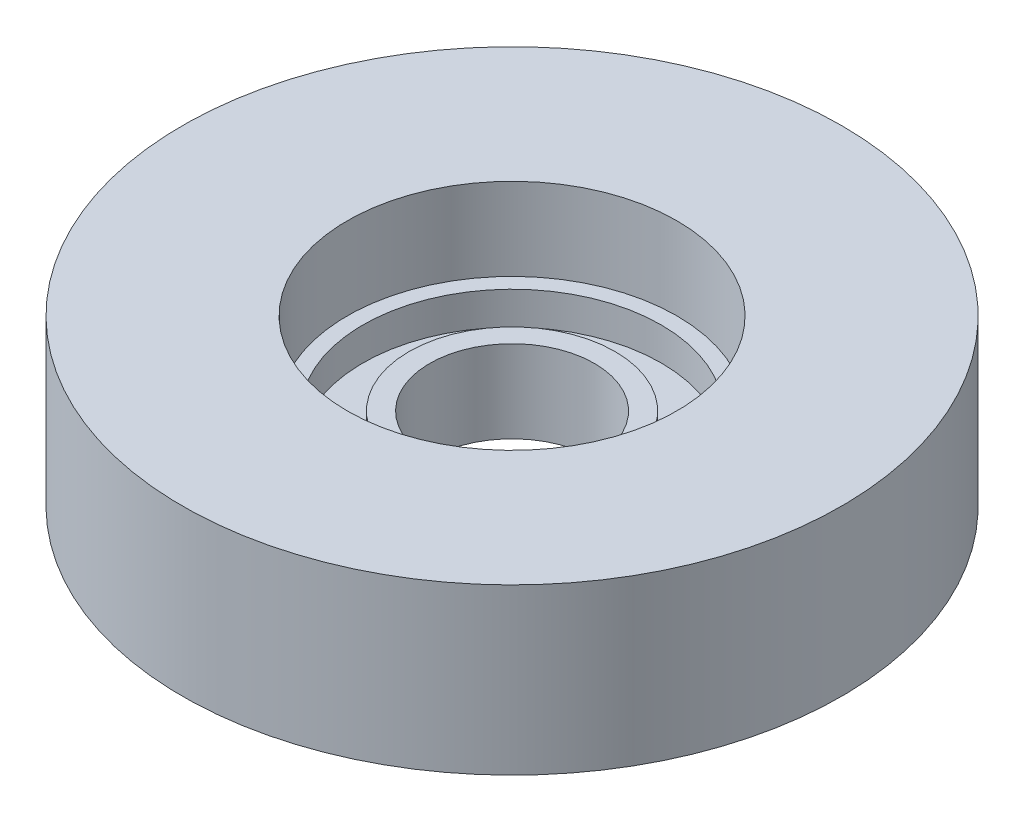
ISO-10303-21;
HEADER;
FILE_DESCRIPTION(('STEP AP214'),'2;1');
FILE_NAME('part.step','',(''),(''),'','','');
FILE_SCHEMA(('AUTOMOTIVE_DESIGN { 1 0 10303 214 1 1 1 1 }'));
ENDSEC;
DATA;
#1=APPLICATION_CONTEXT('core data for automotive mechanical design processes');
#2=APPLICATION_PROTOCOL_DEFINITION('international standard','automotive_design',2000,#1);
#3=PRODUCT_CONTEXT('',#1,'mechanical');
#4=PRODUCT('Part','Part','',(#3));
#5=PRODUCT_RELATED_PRODUCT_CATEGORY('part','',(#4));
#6=PRODUCT_DEFINITION_FORMATION('','',#4);
#7=PRODUCT_DEFINITION_CONTEXT('part definition',#1,'design');
#8=PRODUCT_DEFINITION('design','',#6,#7);
#9=PRODUCT_DEFINITION_SHAPE('','',#8);
#10=(LENGTH_UNIT() NAMED_UNIT(*) SI_UNIT(.MILLI.,.METRE.));
#11=(NAMED_UNIT(*) PLANE_ANGLE_UNIT() SI_UNIT($,.RADIAN.));
#12=(NAMED_UNIT(*) SI_UNIT($,.STERADIAN.) SOLID_ANGLE_UNIT());
#13=UNCERTAINTY_MEASURE_WITH_UNIT(LENGTH_MEASURE(1.E-05),#10,'distance_accuracy_value','');
#14=(GEOMETRIC_REPRESENTATION_CONTEXT(3) GLOBAL_UNCERTAINTY_ASSIGNED_CONTEXT((#13)) GLOBAL_UNIT_ASSIGNED_CONTEXT((#10,
#11,#12)) REPRESENTATION_CONTEXT('',''));
#15=CARTESIAN_POINT('',(0.,0.,0.));
#16=DIRECTION('',(0.,0.,1.));
#17=DIRECTION('',(1.,0.,0.));
#18=AXIS2_PLACEMENT_3D('',#15,#16,#17);
#19=CARTESIAN_POINT('',(-20.2565,0.,0.));
#20=DIRECTION('',(0.,1.,0.));
#21=DIRECTION('',(0.,0.,1.));
#22=AXIS2_PLACEMENT_3D('',#19,#20,#21);
#23=PLANE('',#22);
#24=CARTESIAN_POINT('',(0.,0.,0.));
#25=DIRECTION('',(0.,-1.,0.));
#26=DIRECTION('',(0.,0.,-1.));
#27=AXIS2_PLACEMENT_3D('',#24,#25,#26);
#28=CIRCLE('',#27,6.35);
#29=CARTESIAN_POINT('',(0.,0.,-6.35));
#30=VERTEX_POINT('',#29);
#31=EDGE_CURVE('E10',#30,#30,#28,.T.);
#32=ORIENTED_EDGE('',*,*,#31,.F.);
#33=EDGE_LOOP('',(#32));
#34=FACE_BOUND('',#33,.T.);
#35=CARTESIAN_POINT('',(0.,0.,0.));
#36=DIRECTION('',(0.,-1.,0.));
#37=DIRECTION('',(0.,0.,-1.));
#38=AXIS2_PLACEMENT_3D('',#35,#36,#37);
#39=CIRCLE('',#38,20.2565);
#40=CARTESIAN_POINT('',(0.,0.,-20.2565));
#41=VERTEX_POINT('',#40);
#42=EDGE_CURVE('E83',#41,#41,#39,.T.);
#43=ORIENTED_EDGE('',*,*,#42,.T.);
#44=EDGE_LOOP('',(#43));
#45=FACE_BOUND('',#44,.T.);
#46=ADVANCED_FACE('F37',(#34,#45),#23,.F.);
#47=CARTESIAN_POINT('',(0.,0.,0.));
#48=DIRECTION('',(0.,-1.,0.));
#49=DIRECTION('',(0.,0.,-1.));
#50=AXIS2_PLACEMENT_3D('',#47,#48,#49);
#51=CYLINDRICAL_SURFACE('',#50,6.35);
#52=CARTESIAN_POINT('',(0.,6.35,0.));
#53=DIRECTION('',(0.,-1.,0.));
#54=DIRECTION('',(0.,0.,-1.));
#55=AXIS2_PLACEMENT_3D('',#52,#53,#54);
#56=CIRCLE('',#55,6.35);
#57=CARTESIAN_POINT('',(0.,6.35,-6.35));
#58=VERTEX_POINT('',#57);
#59=EDGE_CURVE('E43',#58,#58,#56,.T.);
#60=ORIENTED_EDGE('',*,*,#59,.F.);
#61=EDGE_LOOP('',(#60));
#62=FACE_BOUND('',#61,.T.);
#63=ORIENTED_EDGE('',*,*,#31,.T.);
#64=EDGE_LOOP('',(#63));
#65=FACE_BOUND('',#64,.T.);
#66=ADVANCED_FACE('F156',(#62,#65),#51,.F.);
#67=CARTESIAN_POINT('',(-7.9375,6.35,0.));
#68=DIRECTION('',(0.,-1.,0.));
#69=DIRECTION('',(0.,0.,-1.));
#70=AXIS2_PLACEMENT_3D('',#67,#68,#69);
#71=PLANE('',#70);
#72=CARTESIAN_POINT('',(0.,6.35,0.));
#73=DIRECTION('',(0.,-1.,0.));
#74=DIRECTION('',(0.,0.,-1.));
#75=AXIS2_PLACEMENT_3D('',#72,#73,#74);
#76=CIRCLE('',#75,7.9375);
#77=CARTESIAN_POINT('',(0.,6.35,-7.9375));
#78=VERTEX_POINT('',#77);
#79=EDGE_CURVE('E47',#78,#78,#76,.T.);
#80=ORIENTED_EDGE('',*,*,#79,.F.);
#81=EDGE_LOOP('',(#80));
#82=FACE_BOUND('',#81,.T.);
#83=ORIENTED_EDGE('',*,*,#59,.T.);
#84=EDGE_LOOP('',(#83));
#85=FACE_BOUND('',#84,.T.);
#86=ADVANCED_FACE('F151',(#82,#85),#71,.F.);
#87=CARTESIAN_POINT('',(0.,0.,0.));
#88=DIRECTION('',(0.,-1.,0.));
#89=DIRECTION('',(0.,0.,-1.));
#90=AXIS2_PLACEMENT_3D('',#87,#88,#89);
#91=CYLINDRICAL_SURFACE('',#90,7.9375);
#92=CARTESIAN_POINT('',(0.,3.81,0.));
#93=DIRECTION('',(0.,-1.,0.));
#94=DIRECTION('',(0.,0.,-1.));
#95=AXIS2_PLACEMENT_3D('',#92,#93,#94);
#96=CIRCLE('',#95,7.9375);
#97=CARTESIAN_POINT('',(0.,3.81,-7.9375));
#98=VERTEX_POINT('',#97);
#99=EDGE_CURVE('E51',#98,#98,#96,.T.);
#100=ORIENTED_EDGE('',*,*,#99,.F.);
#101=EDGE_LOOP('',(#100));
#102=FACE_BOUND('',#101,.T.);
#103=ORIENTED_EDGE('',*,*,#79,.T.);
#104=EDGE_LOOP('',(#103));
#105=FACE_BOUND('',#104,.T.);
#106=ADVANCED_FACE('F145',(#102,#105),#91,.T.);
#107=CARTESIAN_POINT('',(-11.4935,3.81,0.));
#108=DIRECTION('',(0.,-1.,0.));
#109=DIRECTION('',(0.,0.,-1.));
#110=AXIS2_PLACEMENT_3D('',#107,#108,#109);
#111=PLANE('',#110);
#112=CARTESIAN_POINT('',(0.,3.81,0.));
#113=DIRECTION('',(0.,-1.,0.));
#114=DIRECTION('',(0.,0.,-1.));
#115=AXIS2_PLACEMENT_3D('',#112,#113,#114);
#116=CIRCLE('',#115,11.4935);
#117=CARTESIAN_POINT('',(0.,3.81,-11.4935));
#118=VERTEX_POINT('',#117);
#119=EDGE_CURVE('E56',#118,#118,#116,.T.);
#120=ORIENTED_EDGE('',*,*,#119,.F.);
#121=EDGE_LOOP('',(#120));
#122=FACE_BOUND('',#121,.T.);
#123=ORIENTED_EDGE('',*,*,#99,.T.);
#124=EDGE_LOOP('',(#123));
#125=FACE_BOUND('',#124,.T.);
#126=ADVANCED_FACE('F139',(#122,#125),#111,.F.);
#127=CARTESIAN_POINT('',(0.,0.,0.));
#128=DIRECTION('',(0.,-1.,0.));
#129=DIRECTION('',(0.,0.,-1.));
#130=AXIS2_PLACEMENT_3D('',#127,#128,#129);
#131=CYLINDRICAL_SURFACE('',#130,11.4935);
#132=CARTESIAN_POINT('',(0.,6.35,0.));
#133=DIRECTION('',(0.,-1.,0.));
#134=DIRECTION('',(0.,0.,-1.));
#135=AXIS2_PLACEMENT_3D('',#132,#133,#134);
#136=CIRCLE('',#135,11.4935);
#137=CARTESIAN_POINT('',(0.,6.35,-11.4935));
#138=VERTEX_POINT('',#137);
#139=EDGE_CURVE('E59',#138,#138,#136,.T.);
#140=ORIENTED_EDGE('',*,*,#139,.F.);
#141=EDGE_LOOP('',(#140));
#142=FACE_BOUND('',#141,.T.);
#143=ORIENTED_EDGE('',*,*,#119,.T.);
#144=EDGE_LOOP('',(#143));
#145=FACE_BOUND('',#144,.T.);
#146=ADVANCED_FACE('F133',(#142,#145),#131,.F.);
#147=CARTESIAN_POINT('',(-11.4935,6.35,0.));
#148=DIRECTION('',(0.,-1.,0.));
#149=DIRECTION('',(0.,0.,-1.));
#150=AXIS2_PLACEMENT_3D('',#147,#148,#149);
#151=PLANE('',#150);
#152=CARTESIAN_POINT('',(0.,6.35,0.));
#153=DIRECTION('',(0.,-1.,0.));
#154=DIRECTION('',(0.,0.,-1.));
#155=AXIS2_PLACEMENT_3D('',#152,#153,#154);
#156=CIRCLE('',#155,12.7);
#157=CARTESIAN_POINT('',(0.,6.35,-12.7));
#158=VERTEX_POINT('',#157);
#159=EDGE_CURVE('E62',#158,#158,#156,.T.);
#160=ORIENTED_EDGE('',*,*,#159,.F.);
#161=EDGE_LOOP('',(#160));
#162=FACE_BOUND('',#161,.T.);
#163=ORIENTED_EDGE('',*,*,#139,.T.);
#164=EDGE_LOOP('',(#163));
#165=FACE_BOUND('',#164,.T.);
#166=ADVANCED_FACE('F127',(#162,#165),#151,.F.);
#167=CARTESIAN_POINT('',(0.,0.,0.));
#168=DIRECTION('',(0.,-1.,0.));
#169=DIRECTION('',(0.,0.,-1.));
#170=AXIS2_PLACEMENT_3D('',#167,#168,#169);
#171=CYLINDRICAL_SURFACE('',#170,12.7);
#172=CARTESIAN_POINT('',(0.,12.7,0.));
#173=DIRECTION('',(0.,-1.,0.));
#174=DIRECTION('',(0.,0.,-1.));
#175=AXIS2_PLACEMENT_3D('',#172,#173,#174);
#176=CIRCLE('',#175,12.7);
#177=CARTESIAN_POINT('',(0.,12.7,-12.7));
#178=VERTEX_POINT('',#177);
#179=EDGE_CURVE('E65',#178,#178,#176,.T.);
#180=ORIENTED_EDGE('',*,*,#179,.F.);
#181=EDGE_LOOP('',(#180));
#182=FACE_BOUND('',#181,.T.);
#183=ORIENTED_EDGE('',*,*,#159,.T.);
#184=EDGE_LOOP('',(#183));
#185=FACE_BOUND('',#184,.T.);
#186=ADVANCED_FACE('F121',(#182,#185),#171,.F.);
#187=CARTESIAN_POINT('',(-12.7,12.7,0.));
#188=DIRECTION('',(0.,-1.,0.));
#189=DIRECTION('',(0.,0.,-1.));
#190=AXIS2_PLACEMENT_3D('',#187,#188,#189);
#191=PLANE('',#190);
#192=CARTESIAN_POINT('',(0.,12.7,0.));
#193=DIRECTION('',(0.,-1.,0.));
#194=DIRECTION('',(0.,0.,-1.));
#195=AXIS2_PLACEMENT_3D('',#192,#193,#194);
#196=CIRCLE('',#195,25.4);
#197=CARTESIAN_POINT('',(0.,12.7,-25.4));
#198=VERTEX_POINT('',#197);
#199=EDGE_CURVE('E68',#198,#198,#196,.T.);
#200=ORIENTED_EDGE('',*,*,#199,.F.);
#201=EDGE_LOOP('',(#200));
#202=FACE_BOUND('',#201,.T.);
#203=ORIENTED_EDGE('',*,*,#179,.T.);
#204=EDGE_LOOP('',(#203));
#205=FACE_BOUND('',#204,.T.);
#206=ADVANCED_FACE('F115',(#202,#205),#191,.F.);
#207=CARTESIAN_POINT('',(0.,0.,0.));
#208=DIRECTION('',(0.,-1.,0.));
#209=DIRECTION('',(0.,0.,-1.));
#210=AXIS2_PLACEMENT_3D('',#207,#208,#209);
#211=CYLINDRICAL_SURFACE('',#210,25.4);
#212=CARTESIAN_POINT('',(0.,0.,0.));
#213=DIRECTION('',(0.,-1.,0.));
#214=DIRECTION('',(0.,0.,-1.));
#215=AXIS2_PLACEMENT_3D('',#212,#213,#214);
#216=CIRCLE('',#215,25.4);
#217=CARTESIAN_POINT('',(0.,0.,-25.4));
#218=VERTEX_POINT('',#217);
#219=EDGE_CURVE('E71',#218,#218,#216,.T.);
#220=ORIENTED_EDGE('',*,*,#219,.F.);
#221=EDGE_LOOP('',(#220));
#222=FACE_BOUND('',#221,.T.);
#223=ORIENTED_EDGE('',*,*,#199,.T.);
#224=EDGE_LOOP('',(#223));
#225=FACE_BOUND('',#224,.T.);
#226=ADVANCED_FACE('F109',(#222,#225),#211,.T.);
#227=CARTESIAN_POINT('',(-25.4,0.,0.));
#228=DIRECTION('',(0.,1.,0.));
#229=DIRECTION('',(0.,0.,1.));
#230=AXIS2_PLACEMENT_3D('',#227,#228,#229);
#231=PLANE('',#230);
#232=CARTESIAN_POINT('',(0.,0.,0.));
#233=DIRECTION('',(0.,-1.,0.));
#234=DIRECTION('',(0.,0.,-1.));
#235=AXIS2_PLACEMENT_3D('',#232,#233,#234);
#236=CIRCLE('',#235,23.8125);
#237=CARTESIAN_POINT('',(0.,0.,-23.8125));
#238=VERTEX_POINT('',#237);
#239=EDGE_CURVE('E74',#238,#238,#236,.T.);
#240=ORIENTED_EDGE('',*,*,#239,.F.);
#241=EDGE_LOOP('',(#240));
#242=FACE_BOUND('',#241,.T.);
#243=ORIENTED_EDGE('',*,*,#219,.T.);
#244=EDGE_LOOP('',(#243));
#245=FACE_BOUND('',#244,.T.);
#246=ADVANCED_FACE('F103',(#242,#245),#231,.F.);
#247=CARTESIAN_POINT('',(0.,0.,0.));
#248=DIRECTION('',(0.,-1.,0.));
#249=DIRECTION('',(0.,0.,-1.));
#250=AXIS2_PLACEMENT_3D('',#247,#248,#249);
#251=CYLINDRICAL_SURFACE('',#250,23.8125);
#252=CARTESIAN_POINT('',(0.,2.54,0.));
#253=DIRECTION('',(0.,-1.,0.));
#254=DIRECTION('',(0.,0.,-1.));
#255=AXIS2_PLACEMENT_3D('',#252,#253,#254);
#256=CIRCLE('',#255,23.8125);
#257=CARTESIAN_POINT('',(0.,2.54,-23.8125));
#258=VERTEX_POINT('',#257);
#259=EDGE_CURVE('E77',#258,#258,#256,.T.);
#260=ORIENTED_EDGE('',*,*,#259,.F.);
#261=EDGE_LOOP('',(#260));
#262=FACE_BOUND('',#261,.T.);
#263=ORIENTED_EDGE('',*,*,#239,.T.);
#264=EDGE_LOOP('',(#263));
#265=FACE_BOUND('',#264,.T.);
#266=ADVANCED_FACE('F97',(#262,#265),#251,.F.);
#267=CARTESIAN_POINT('',(-23.8125,2.54,0.));
#268=DIRECTION('',(0.,1.,0.));
#269=DIRECTION('',(0.,0.,1.));
#270=AXIS2_PLACEMENT_3D('',#267,#268,#269);
#271=PLANE('',#270);
#272=CARTESIAN_POINT('',(0.,2.54,0.));
#273=DIRECTION('',(0.,-1.,0.));
#274=DIRECTION('',(0.,0.,-1.));
#275=AXIS2_PLACEMENT_3D('',#272,#273,#274);
#276=CIRCLE('',#275,20.2565);
#277=CARTESIAN_POINT('',(0.,2.54,-20.2565));
#278=VERTEX_POINT('',#277);
#279=EDGE_CURVE('E80',#278,#278,#276,.T.);
#280=ORIENTED_EDGE('',*,*,#279,.F.);
#281=EDGE_LOOP('',(#280));
#282=FACE_BOUND('',#281,.T.);
#283=ORIENTED_EDGE('',*,*,#259,.T.);
#284=EDGE_LOOP('',(#283));
#285=FACE_BOUND('',#284,.T.);
#286=ADVANCED_FACE('F91',(#282,#285),#271,.F.);
#287=CARTESIAN_POINT('',(0.,0.,0.));
#288=DIRECTION('',(0.,-1.,0.));
#289=DIRECTION('',(0.,0.,-1.));
#290=AXIS2_PLACEMENT_3D('',#287,#288,#289);
#291=CYLINDRICAL_SURFACE('',#290,20.2565);
#292=ORIENTED_EDGE('',*,*,#42,.F.);
#293=EDGE_LOOP('',(#292));
#294=FACE_BOUND('',#293,.T.);
#295=ORIENTED_EDGE('',*,*,#279,.T.);
#296=EDGE_LOOP('',(#295));
#297=FACE_BOUND('',#296,.T.);
#298=ADVANCED_FACE('F88',(#294,#297),#291,.T.);
#299=CLOSED_SHELL('',(#46,#66,#86,#106,#126,#146,#166,#186,#206,#226,#246,#266,#286,#298));
#300=MANIFOLD_SOLID_BREP('B2',#299);
#301=ADVANCED_BREP_SHAPE_REPRESENTATION('',(#18,#300),#14);
#302=SHAPE_DEFINITION_REPRESENTATION(#9,#301);
ENDSEC;
END-ISO-10303-21;
